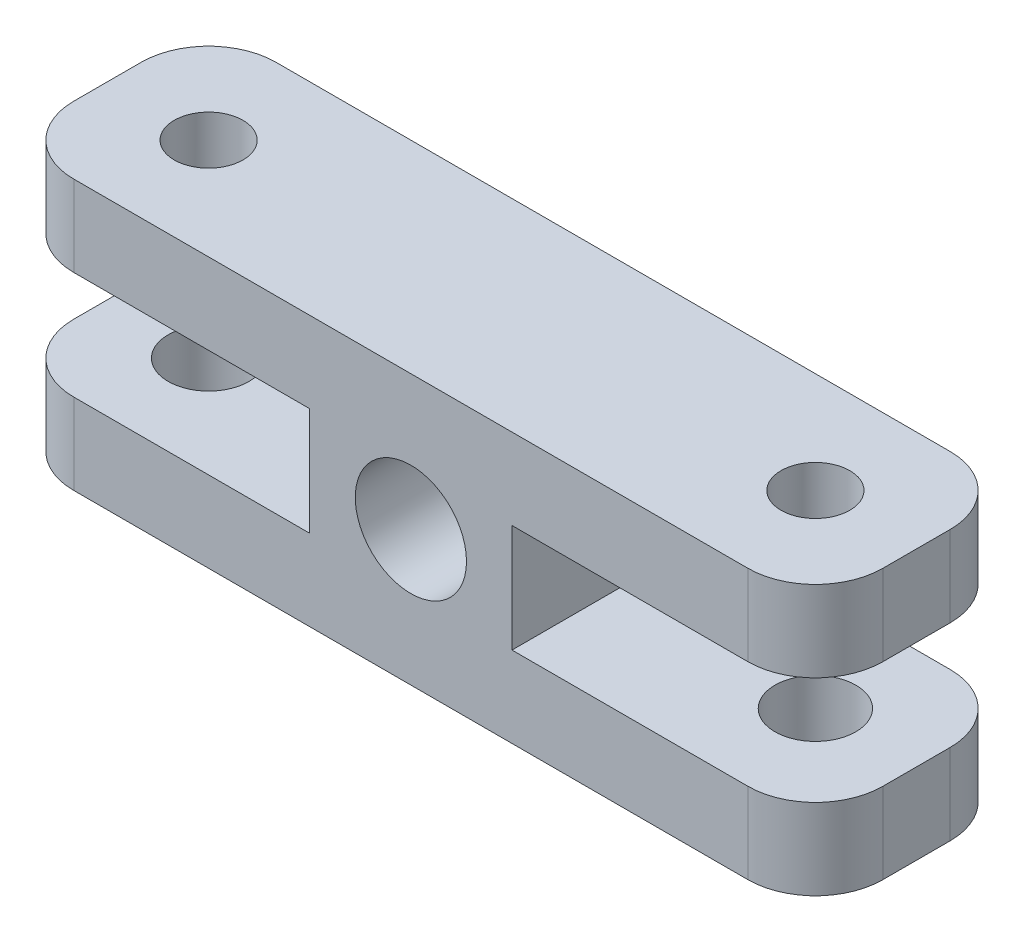
ISO-10303-21;
HEADER;
FILE_DESCRIPTION(('STEP AP214'),'2;1');
FILE_NAME('part.step','',(''),(''),'','','');
FILE_SCHEMA(('AUTOMOTIVE_DESIGN { 1 0 10303 214 1 1 1 1 }'));
ENDSEC;
DATA;
#1=APPLICATION_CONTEXT('core data for automotive mechanical design processes');
#2=APPLICATION_PROTOCOL_DEFINITION('international standard','automotive_design',2000,#1);
#3=PRODUCT_CONTEXT('',#1,'mechanical');
#4=PRODUCT('Part','Part','',(#3));
#5=PRODUCT_RELATED_PRODUCT_CATEGORY('part','',(#4));
#6=PRODUCT_DEFINITION_FORMATION('','',#4);
#7=PRODUCT_DEFINITION_CONTEXT('part definition',#1,'design');
#8=PRODUCT_DEFINITION('design','',#6,#7);
#9=PRODUCT_DEFINITION_SHAPE('','',#8);
#10=(LENGTH_UNIT() NAMED_UNIT(*) SI_UNIT(.MILLI.,.METRE.));
#11=(NAMED_UNIT(*) PLANE_ANGLE_UNIT() SI_UNIT($,.RADIAN.));
#12=(NAMED_UNIT(*) SI_UNIT($,.STERADIAN.) SOLID_ANGLE_UNIT());
#13=UNCERTAINTY_MEASURE_WITH_UNIT(LENGTH_MEASURE(1.E-05),#10,'distance_accuracy_value','');
#14=(GEOMETRIC_REPRESENTATION_CONTEXT(3) GLOBAL_UNCERTAINTY_ASSIGNED_CONTEXT((#13)) GLOBAL_UNIT_ASSIGNED_CONTEXT((#10,
#11,#12)) REPRESENTATION_CONTEXT('',''));
#15=CARTESIAN_POINT('',(0.,0.,0.));
#16=DIRECTION('',(0.,0.,1.));
#17=DIRECTION('',(1.,0.,0.));
#18=AXIS2_PLACEMENT_3D('',#15,#16,#17);
#19=CARTESIAN_POINT('',(60.,-20.,15.));
#20=DIRECTION('',(-1.,0.,0.));
#21=DIRECTION('',(0.,0.,1.));
#22=AXIS2_PLACEMENT_3D('',#19,#20,#21);
#23=PLANE('',#22);
#24=DIRECTION('',(0.,0.,-1.));
#25=VECTOR('',#24,1.);
#26=CARTESIAN_POINT('',(60.,20.,15.));
#27=LINE('',#26,#25);
#28=CARTESIAN_POINT('',(60.,20.,5.));
#29=VERTEX_POINT('',#28);
#30=CARTESIAN_POINT('',(60.,20.,-5.));
#31=VERTEX_POINT('',#30);
#32=EDGE_CURVE('E279',#29,#31,#27,.T.);
#33=ORIENTED_EDGE('',*,*,#32,.F.);
#34=DIRECTION('',(0.,1.,0.));
#35=VECTOR('',#34,1.);
#36=CARTESIAN_POINT('',(60.,-20.,5.));
#37=LINE('',#36,#35);
#38=CARTESIAN_POINT('',(60.,8.,5.));
#39=VERTEX_POINT('',#38);
#40=EDGE_CURVE('E309',#29,#39,#37,.F.);
#41=ORIENTED_EDGE('',*,*,#40,.T.);
#42=DIRECTION('',(0.,0.,1.));
#43=VECTOR('',#42,1.);
#44=CARTESIAN_POINT('',(60.,8.,-15.));
#45=LINE('',#44,#43);
#46=CARTESIAN_POINT('',(60.,8.,-5.));
#47=VERTEX_POINT('',#46);
#48=EDGE_CURVE('E212',#47,#39,#45,.T.);
#49=ORIENTED_EDGE('',*,*,#48,.F.);
#50=DIRECTION('',(0.,1.,0.));
#51=VECTOR('',#50,1.);
#52=CARTESIAN_POINT('',(60.,20.,-5.));
#53=LINE('',#52,#51);
#54=EDGE_CURVE('E306',#47,#31,#53,.T.);
#55=ORIENTED_EDGE('',*,*,#54,.T.);
#56=EDGE_LOOP('',(#33,#41,#49,#55));
#57=FACE_BOUND('',#56,.T.);
#58=ADVANCED_FACE('F37',(#57),#23,.F.);
#59=CARTESIAN_POINT('',(-60.,-20.,15.));
#60=DIRECTION('',(1.,0.,0.));
#61=DIRECTION('',(0.,0.,-1.));
#62=AXIS2_PLACEMENT_3D('',#59,#60,#61);
#63=PLANE('',#62);
#64=DIRECTION('',(0.,0.,1.));
#65=VECTOR('',#64,1.);
#66=CARTESIAN_POINT('',(-60.,7.99999999999999,-15.));
#67=LINE('',#66,#65);
#68=CARTESIAN_POINT('',(-60.,7.99999999999999,-5.));
#69=VERTEX_POINT('',#68);
#70=CARTESIAN_POINT('',(-60.,7.99999999999999,5.));
#71=VERTEX_POINT('',#70);
#72=EDGE_CURVE('E236',#69,#71,#67,.T.);
#73=ORIENTED_EDGE('',*,*,#72,.T.);
#74=DIRECTION('',(0.,-1.,0.));
#75=VECTOR('',#74,1.);
#76=CARTESIAN_POINT('',(-60.,-20.,5.));
#77=LINE('',#76,#75);
#78=CARTESIAN_POINT('',(-60.,20.,5.));
#79=VERTEX_POINT('',#78);
#80=EDGE_CURVE('E346',#71,#79,#77,.F.);
#81=ORIENTED_EDGE('',*,*,#80,.T.);
#82=DIRECTION('',(0.,0.,-1.));
#83=VECTOR('',#82,1.);
#84=CARTESIAN_POINT('',(-60.,20.,15.));
#85=LINE('',#84,#83);
#86=CARTESIAN_POINT('',(-60.,20.,-5.));
#87=VERTEX_POINT('',#86);
#88=EDGE_CURVE('E276',#79,#87,#85,.T.);
#89=ORIENTED_EDGE('',*,*,#88,.T.);
#90=DIRECTION('',(0.,-1.,0.));
#91=VECTOR('',#90,1.);
#92=CARTESIAN_POINT('',(-60.,7.99999999999999,-5.));
#93=LINE('',#92,#91);
#94=EDGE_CURVE('E343',#87,#69,#93,.T.);
#95=ORIENTED_EDGE('',*,*,#94,.T.);
#96=EDGE_LOOP('',(#73,#81,#89,#95));
#97=FACE_BOUND('',#96,.T.);
#98=ADVANCED_FACE('F390',(#97),#63,.F.);
#99=DIRECTION('',(0.,0.,1.));
#100=VECTOR('',#99,1.);
#101=CARTESIAN_POINT('',(60.,-8.,-15.));
#102=LINE('',#101,#100);
#103=CARTESIAN_POINT('',(60.,-8.,-5.));
#104=VERTEX_POINT('',#103);
#105=CARTESIAN_POINT('',(60.,-8.,5.));
#106=VERTEX_POINT('',#105);
#107=EDGE_CURVE('E215',#104,#106,#102,.T.);
#108=ORIENTED_EDGE('',*,*,#107,.T.);
#109=DIRECTION('',(0.,1.,0.));
#110=VECTOR('',#109,1.);
#111=CARTESIAN_POINT('',(60.,-20.,5.));
#112=LINE('',#111,#110);
#113=CARTESIAN_POINT('',(60.,-20.,5.));
#114=VERTEX_POINT('',#113);
#115=EDGE_CURVE('E322',#106,#114,#112,.F.);
#116=ORIENTED_EDGE('',*,*,#115,.T.);
#117=DIRECTION('',(0.,0.,-1.));
#118=VECTOR('',#117,1.);
#119=CARTESIAN_POINT('',(60.,-20.,15.));
#120=LINE('',#119,#118);
#121=CARTESIAN_POINT('',(60.,-20.,-5.));
#122=VERTEX_POINT('',#121);
#123=EDGE_CURVE('E266',#114,#122,#120,.T.);
#124=ORIENTED_EDGE('',*,*,#123,.T.);
#125=DIRECTION('',(0.,1.,0.));
#126=VECTOR('',#125,1.);
#127=CARTESIAN_POINT('',(60.,-8.,-5.));
#128=LINE('',#127,#126);
#129=EDGE_CURVE('E319',#122,#104,#128,.T.);
#130=ORIENTED_EDGE('',*,*,#129,.T.);
#131=EDGE_LOOP('',(#108,#116,#124,#130));
#132=FACE_BOUND('',#131,.T.);
#133=ADVANCED_FACE('F393',(#132),#23,.F.);
#134=CARTESIAN_POINT('',(-60.,20.,15.));
#135=DIRECTION('',(0.,-1.,0.));
#136=DIRECTION('',(0.,0.,-1.));
#137=AXIS2_PLACEMENT_3D('',#134,#135,#136);
#138=PLANE('',#137);
#139=CARTESIAN_POINT('',(-45.,20.,0.));
#140=DIRECTION('',(0.,1.,0.));
#141=DIRECTION('',(0.,0.,1.));
#142=AXIS2_PLACEMENT_3D('',#139,#140,#141);
#143=CIRCLE('',#142,5.09999999999999);
#144=CARTESIAN_POINT('',(-45.,20.,5.1));
#145=VERTEX_POINT('',#144);
#146=EDGE_CURVE('E660',#145,#145,#143,.T.);
#147=ORIENTED_EDGE('',*,*,#146,.F.);
#148=EDGE_LOOP('',(#147));
#149=FACE_BOUND('',#148,.T.);
#150=CARTESIAN_POINT('',(45.,20.,0.));
#151=DIRECTION('',(0.,1.,0.));
#152=DIRECTION('',(0.,0.,1.));
#153=AXIS2_PLACEMENT_3D('',#150,#151,#152);
#154=CIRCLE('',#153,5.09999999999999);
#155=CARTESIAN_POINT('',(45.,20.,5.09999999999999));
#156=VERTEX_POINT('',#155);
#157=EDGE_CURVE('E663',#156,#156,#154,.T.);
#158=ORIENTED_EDGE('',*,*,#157,.F.);
#159=EDGE_LOOP('',(#158));
#160=FACE_BOUND('',#159,.T.);
#161=DIRECTION('',(-1.,0.,0.));
#162=VECTOR('',#161,1.);
#163=CARTESIAN_POINT('',(-60.,20.,15.));
#164=LINE('',#163,#162);
#165=CARTESIAN_POINT('',(50.,20.,15.));
#166=VERTEX_POINT('',#165);
#167=CARTESIAN_POINT('',(-50.,20.,15.));
#168=VERTEX_POINT('',#167);
#169=EDGE_CURVE('E259',#166,#168,#164,.T.);
#170=ORIENTED_EDGE('',*,*,#169,.F.);
#171=CARTESIAN_POINT('',(50.,20.,5.));
#172=DIRECTION('',(0.,-1.,0.));
#173=DIRECTION('',(0.,0.,-1.));
#174=AXIS2_PLACEMENT_3D('',#171,#172,#173);
#175=CIRCLE('',#174,10.);
#176=EDGE_CURVE('E304',#166,#29,#175,.F.);
#177=ORIENTED_EDGE('',*,*,#176,.T.);
#178=ORIENTED_EDGE('',*,*,#32,.T.);
#179=CARTESIAN_POINT('',(50.,20.,-5.));
#180=DIRECTION('',(0.,-1.,0.));
#181=DIRECTION('',(0.,0.,-1.));
#182=AXIS2_PLACEMENT_3D('',#179,#180,#181);
#183=CIRCLE('',#182,10.);
#184=CARTESIAN_POINT('',(50.,20.,-15.));
#185=VERTEX_POINT('',#184);
#186=EDGE_CURVE('E302',#31,#185,#183,.F.);
#187=ORIENTED_EDGE('',*,*,#186,.T.);
#188=DIRECTION('',(-1.,0.,0.));
#189=VECTOR('',#188,1.);
#190=CARTESIAN_POINT('',(-60.,20.,-15.));
#191=LINE('',#190,#189);
#192=CARTESIAN_POINT('',(-50.,20.,-15.));
#193=VERTEX_POINT('',#192);
#194=EDGE_CURVE('E258',#185,#193,#191,.T.);
#195=ORIENTED_EDGE('',*,*,#194,.T.);
#196=CARTESIAN_POINT('',(-50.,20.,-5.));
#197=DIRECTION('',(0.,-1.,0.));
#198=DIRECTION('',(0.,0.,-1.));
#199=AXIS2_PLACEMENT_3D('',#196,#197,#198);
#200=CIRCLE('',#199,10.);
#201=EDGE_CURVE('E298',#193,#87,#200,.F.);
#202=ORIENTED_EDGE('',*,*,#201,.T.);
#203=ORIENTED_EDGE('',*,*,#88,.F.);
#204=CARTESIAN_POINT('',(-50.,20.,5.));
#205=DIRECTION('',(0.,-1.,0.));
#206=DIRECTION('',(0.,0.,-1.));
#207=AXIS2_PLACEMENT_3D('',#204,#205,#206);
#208=CIRCLE('',#207,10.);
#209=EDGE_CURVE('E300',#79,#168,#208,.F.);
#210=ORIENTED_EDGE('',*,*,#209,.T.);
#211=EDGE_LOOP('',(#170,#177,#178,#187,#195,#202,#203,#210));
#212=FACE_BOUND('',#211,.T.);
#213=ADVANCED_FACE('F403',(#149,#160,#212),#138,.F.);
#214=DIRECTION('',(0.,0.,-1.));
#215=VECTOR('',#214,1.);
#216=CARTESIAN_POINT('',(-60.,-20.,15.));
#217=LINE('',#216,#215);
#218=CARTESIAN_POINT('',(-60.,-20.,5.));
#219=VERTEX_POINT('',#218);
#220=CARTESIAN_POINT('',(-60.,-20.,-5.));
#221=VERTEX_POINT('',#220);
#222=EDGE_CURVE('E273',#219,#221,#217,.T.);
#223=ORIENTED_EDGE('',*,*,#222,.F.);
#224=DIRECTION('',(0.,-1.,0.));
#225=VECTOR('',#224,1.);
#226=CARTESIAN_POINT('',(-60.,-20.,5.));
#227=LINE('',#226,#225);
#228=CARTESIAN_POINT('',(-60.,-8.00000000000001,5.));
#229=VERTEX_POINT('',#228);
#230=EDGE_CURVE('E52',#219,#229,#227,.F.);
#231=ORIENTED_EDGE('',*,*,#230,.T.);
#232=DIRECTION('',(0.,0.,1.));
#233=VECTOR('',#232,1.);
#234=CARTESIAN_POINT('',(-60.,-8.00000000000001,-15.));
#235=LINE('',#234,#233);
#236=CARTESIAN_POINT('',(-60.,-8.00000000000001,-5.));
#237=VERTEX_POINT('',#236);
#238=EDGE_CURVE('E228',#237,#229,#235,.T.);
#239=ORIENTED_EDGE('',*,*,#238,.F.);
#240=DIRECTION('',(0.,-1.,0.));
#241=VECTOR('',#240,1.);
#242=CARTESIAN_POINT('',(-60.,-20.,-5.));
#243=LINE('',#242,#241);
#244=EDGE_CURVE('E348',#237,#221,#243,.T.);
#245=ORIENTED_EDGE('',*,*,#244,.T.);
#246=EDGE_LOOP('',(#223,#231,#239,#245));
#247=FACE_BOUND('',#246,.T.);
#248=ADVANCED_FACE('F352',(#247),#63,.F.);
#249=CARTESIAN_POINT('',(-60.,-20.,15.));
#250=DIRECTION('',(0.,1.,0.));
#251=DIRECTION('',(0.,0.,1.));
#252=AXIS2_PLACEMENT_3D('',#249,#250,#251);
#253=PLANE('',#252);
#254=CARTESIAN_POINT('',(45.,-20.,0.));
#255=DIRECTION('',(0.,-1.,0.));
#256=DIRECTION('',(0.,0.,-1.));
#257=AXIS2_PLACEMENT_3D('',#254,#255,#256);
#258=CIRCLE('',#257,6.);
#259=CARTESIAN_POINT('',(45.,-20.,-5.99999999999999));
#260=VERTEX_POINT('',#259);
#261=EDGE_CURVE('E252',#260,#260,#258,.T.);
#262=ORIENTED_EDGE('',*,*,#261,.F.);
#263=EDGE_LOOP('',(#262));
#264=FACE_BOUND('',#263,.T.);
#265=CARTESIAN_POINT('',(-45.,-20.,0.));
#266=DIRECTION('',(0.,-1.,0.));
#267=DIRECTION('',(0.,0.,-1.));
#268=AXIS2_PLACEMENT_3D('',#265,#266,#267);
#269=CIRCLE('',#268,6.);
#270=CARTESIAN_POINT('',(-45.,-20.,-6.));
#271=VERTEX_POINT('',#270);
#272=EDGE_CURVE('E255',#271,#271,#269,.T.);
#273=ORIENTED_EDGE('',*,*,#272,.F.);
#274=EDGE_LOOP('',(#273));
#275=FACE_BOUND('',#274,.T.);
#276=ORIENTED_EDGE('',*,*,#123,.F.);
#277=CARTESIAN_POINT('',(50.,-20.,5.));
#278=DIRECTION('',(0.,1.,0.));
#279=DIRECTION('',(0.,0.,1.));
#280=AXIS2_PLACEMENT_3D('',#277,#278,#279);
#281=CIRCLE('',#280,10.);
#282=CARTESIAN_POINT('',(50.,-20.,15.));
#283=VERTEX_POINT('',#282);
#284=EDGE_CURVE('E330',#114,#283,#281,.F.);
#285=ORIENTED_EDGE('',*,*,#284,.T.);
#286=DIRECTION('',(1.,0.,0.));
#287=VECTOR('',#286,1.);
#288=CARTESIAN_POINT('',(-60.,-20.,15.));
#289=LINE('',#288,#287);
#290=CARTESIAN_POINT('',(-50.,-20.,15.));
#291=VERTEX_POINT('',#290);
#292=EDGE_CURVE('E262',#291,#283,#289,.T.);
#293=ORIENTED_EDGE('',*,*,#292,.F.);
#294=CARTESIAN_POINT('',(-50.,-20.,5.));
#295=DIRECTION('',(0.,1.,0.));
#296=DIRECTION('',(0.,0.,1.));
#297=AXIS2_PLACEMENT_3D('',#294,#295,#296);
#298=CIRCLE('',#297,10.);
#299=EDGE_CURVE('E326',#291,#219,#298,.F.);
#300=ORIENTED_EDGE('',*,*,#299,.T.);
#301=ORIENTED_EDGE('',*,*,#222,.T.);
#302=CARTESIAN_POINT('',(-50.,-20.,-5.));
#303=DIRECTION('',(0.,1.,0.));
#304=DIRECTION('',(0.,0.,1.));
#305=AXIS2_PLACEMENT_3D('',#302,#303,#304);
#306=CIRCLE('',#305,10.);
#307=CARTESIAN_POINT('',(-50.,-20.,-15.));
#308=VERTEX_POINT('',#307);
#309=EDGE_CURVE('E324',#221,#308,#306,.F.);
#310=ORIENTED_EDGE('',*,*,#309,.T.);
#311=DIRECTION('',(1.,0.,0.));
#312=VECTOR('',#311,1.);
#313=CARTESIAN_POINT('',(-60.,-20.,-15.));
#314=LINE('',#313,#312);
#315=CARTESIAN_POINT('',(50.,-20.,-15.));
#316=VERTEX_POINT('',#315);
#317=EDGE_CURVE('E263',#308,#316,#314,.T.);
#318=ORIENTED_EDGE('',*,*,#317,.T.);
#319=CARTESIAN_POINT('',(50.,-20.,-5.));
#320=DIRECTION('',(0.,1.,0.));
#321=DIRECTION('',(0.,0.,1.));
#322=AXIS2_PLACEMENT_3D('',#319,#320,#321);
#323=CIRCLE('',#322,10.);
#324=EDGE_CURVE('E328',#316,#122,#323,.F.);
#325=ORIENTED_EDGE('',*,*,#324,.T.);
#326=EDGE_LOOP('',(#276,#285,#293,#300,#301,#310,#318,#325));
#327=FACE_BOUND('',#326,.T.);
#328=ADVANCED_FACE('F356',(#264,#275,#327),#253,.F.);
#329=CARTESIAN_POINT('',(0.,0.,15.));
#330=DIRECTION('',(0.,0.,-1.));
#331=DIRECTION('',(-1.,0.,0.));
#332=AXIS2_PLACEMENT_3D('',#329,#330,#331);
#333=PLANE('',#332);
#334=CARTESIAN_POINT('',(0.,0.,15.));
#335=DIRECTION('',(0.,0.,1.));
#336=DIRECTION('',(1.,0.,0.));
#337=AXIS2_PLACEMENT_3D('',#334,#335,#336);
#338=CIRCLE('',#337,8.25);
#339=CARTESIAN_POINT('',(8.25,0.,15.));
#340=VERTEX_POINT('',#339);
#341=EDGE_CURVE('E246',#340,#340,#338,.T.);
#342=ORIENTED_EDGE('',*,*,#341,.F.);
#343=EDGE_LOOP('',(#342));
#344=FACE_BOUND('',#343,.T.);
#345=DIRECTION('',(-1.,0.,0.));
#346=VECTOR('',#345,1.);
#347=CARTESIAN_POINT('',(60.,8.,15.));
#348=LINE('',#347,#346);
#349=CARTESIAN_POINT('',(50.,8.,15.));
#350=VERTEX_POINT('',#349);
#351=CARTESIAN_POINT('',(15.,8.,15.));
#352=VERTEX_POINT('',#351);
#353=EDGE_CURVE('E193',#350,#352,#348,.T.);
#354=ORIENTED_EDGE('',*,*,#353,.F.);
#355=DIRECTION('',(0.,1.,0.));
#356=VECTOR('',#355,1.);
#357=CARTESIAN_POINT('',(50.,0.,15.));
#358=LINE('',#357,#356);
#359=EDGE_CURVE('E295',#350,#166,#358,.T.);
#360=ORIENTED_EDGE('',*,*,#359,.T.);
#361=ORIENTED_EDGE('',*,*,#169,.T.);
#362=DIRECTION('',(0.,-1.,0.));
#363=VECTOR('',#362,1.);
#364=CARTESIAN_POINT('',(-50.,0.,15.));
#365=LINE('',#364,#363);
#366=CARTESIAN_POINT('',(-50.,7.99999999999999,15.));
#367=VERTEX_POINT('',#366);
#368=EDGE_CURVE('E289',#168,#367,#365,.T.);
#369=ORIENTED_EDGE('',*,*,#368,.T.);
#370=DIRECTION('',(-1.,0.,0.));
#371=VECTOR('',#370,1.);
#372=CARTESIAN_POINT('',(-60.,7.99999999999999,15.));
#373=LINE('',#372,#371);
#374=CARTESIAN_POINT('',(-15.,8.,15.));
#375=VERTEX_POINT('',#374);
#376=EDGE_CURVE('E222',#375,#367,#373,.T.);
#377=ORIENTED_EDGE('',*,*,#376,.F.);
#378=DIRECTION('',(0.,1.,0.));
#379=VECTOR('',#378,1.);
#380=CARTESIAN_POINT('',(-15.,8.,15.));
#381=LINE('',#380,#379);
#382=CARTESIAN_POINT('',(-15.,-8.00000000000001,15.));
#383=VERTEX_POINT('',#382);
#384=EDGE_CURVE('E231',#383,#375,#381,.T.);
#385=ORIENTED_EDGE('',*,*,#384,.F.);
#386=DIRECTION('',(1.,0.,0.));
#387=VECTOR('',#386,1.);
#388=CARTESIAN_POINT('',(-60.,-8.00000000000001,15.));
#389=LINE('',#388,#387);
#390=CARTESIAN_POINT('',(-50.,-8.00000000000001,15.));
#391=VERTEX_POINT('',#390);
#392=EDGE_CURVE('E229',#391,#383,#389,.T.);
#393=ORIENTED_EDGE('',*,*,#392,.F.);
#394=DIRECTION('',(0.,-1.,0.));
#395=VECTOR('',#394,1.);
#396=CARTESIAN_POINT('',(-50.,0.,15.));
#397=LINE('',#396,#395);
#398=EDGE_CURVE('E282',#391,#291,#397,.T.);
#399=ORIENTED_EDGE('',*,*,#398,.T.);
#400=ORIENTED_EDGE('',*,*,#292,.T.);
#401=DIRECTION('',(0.,1.,0.));
#402=VECTOR('',#401,1.);
#403=CARTESIAN_POINT('',(50.,0.,15.));
#404=LINE('',#403,#402);
#405=CARTESIAN_POINT('',(50.,-8.,15.));
#406=VERTEX_POINT('',#405);
#407=EDGE_CURVE('E292',#283,#406,#404,.T.);
#408=ORIENTED_EDGE('',*,*,#407,.T.);
#409=DIRECTION('',(1.,0.,0.));
#410=VECTOR('',#409,1.);
#411=CARTESIAN_POINT('',(60.,-8.,15.));
#412=LINE('',#411,#410);
#413=CARTESIAN_POINT('',(15.,-8.00000000000001,15.));
#414=VERTEX_POINT('',#413);
#415=EDGE_CURVE('E186',#414,#406,#412,.T.);
#416=ORIENTED_EDGE('',*,*,#415,.F.);
#417=DIRECTION('',(0.,-1.,0.));
#418=VECTOR('',#417,1.);
#419=CARTESIAN_POINT('',(15.,8.,15.));
#420=LINE('',#419,#418);
#421=EDGE_CURVE('E207',#352,#414,#420,.T.);
#422=ORIENTED_EDGE('',*,*,#421,.F.);
#423=EDGE_LOOP('',(#354,#360,#361,#369,#377,#385,#393,#399,#400,#408,#416,#422));
#424=FACE_BOUND('',#423,.T.);
#425=ADVANCED_FACE('F365',(#344,#424),#333,.F.);
#426=CARTESIAN_POINT('',(0.,0.,-15.));
#427=DIRECTION('',(0.,0.,-1.));
#428=DIRECTION('',(-1.,0.,0.));
#429=AXIS2_PLACEMENT_3D('',#426,#427,#428);
#430=PLANE('',#429);
#431=DIRECTION('',(1.,0.,0.));
#432=VECTOR('',#431,1.);
#433=CARTESIAN_POINT('',(60.,-8.,-15.));
#434=LINE('',#433,#432);
#435=CARTESIAN_POINT('',(15.,-8.00000000000001,-15.));
#436=VERTEX_POINT('',#435);
#437=CARTESIAN_POINT('',(50.,-8.,-15.));
#438=VERTEX_POINT('',#437);
#439=EDGE_CURVE('E198',#436,#438,#434,.T.);
#440=ORIENTED_EDGE('',*,*,#439,.T.);
#441=DIRECTION('',(0.,1.,0.));
#442=VECTOR('',#441,1.);
#443=CARTESIAN_POINT('',(50.,-20.,-15.));
#444=LINE('',#443,#442);
#445=EDGE_CURVE('E337',#438,#316,#444,.F.);
#446=ORIENTED_EDGE('',*,*,#445,.T.);
#447=ORIENTED_EDGE('',*,*,#317,.F.);
#448=DIRECTION('',(0.,-1.,0.));
#449=VECTOR('',#448,1.);
#450=CARTESIAN_POINT('',(-50.,-8.00000000000001,-15.));
#451=LINE('',#450,#449);
#452=CARTESIAN_POINT('',(-50.,-8.00000000000001,-15.));
#453=VERTEX_POINT('',#452);
#454=EDGE_CURVE('E332',#308,#453,#451,.F.);
#455=ORIENTED_EDGE('',*,*,#454,.T.);
#456=DIRECTION('',(1.,0.,0.));
#457=VECTOR('',#456,1.);
#458=CARTESIAN_POINT('',(-60.,-8.00000000000001,-15.));
#459=LINE('',#458,#457);
#460=CARTESIAN_POINT('',(-15.,-8.00000000000001,-15.));
#461=VERTEX_POINT('',#460);
#462=EDGE_CURVE('E219',#453,#461,#459,.T.);
#463=ORIENTED_EDGE('',*,*,#462,.T.);
#464=DIRECTION('',(0.,1.,0.));
#465=VECTOR('',#464,1.);
#466=CARTESIAN_POINT('',(-15.,8.,-15.));
#467=LINE('',#466,#465);
#468=CARTESIAN_POINT('',(-15.,8.,-15.));
#469=VERTEX_POINT('',#468);
#470=EDGE_CURVE('E221',#461,#469,#467,.T.);
#471=ORIENTED_EDGE('',*,*,#470,.T.);
#472=DIRECTION('',(-1.,0.,0.));
#473=VECTOR('',#472,1.);
#474=CARTESIAN_POINT('',(-60.,7.99999999999999,-15.));
#475=LINE('',#474,#473);
#476=CARTESIAN_POINT('',(-50.,7.99999999999999,-15.));
#477=VERTEX_POINT('',#476);
#478=EDGE_CURVE('E225',#469,#477,#475,.T.);
#479=ORIENTED_EDGE('',*,*,#478,.T.);
#480=DIRECTION('',(0.,-1.,0.));
#481=VECTOR('',#480,1.);
#482=CARTESIAN_POINT('',(-50.,20.,-15.));
#483=LINE('',#482,#481);
#484=EDGE_CURVE('E334',#477,#193,#483,.F.);
#485=ORIENTED_EDGE('',*,*,#484,.T.);
#486=ORIENTED_EDGE('',*,*,#194,.F.);
#487=DIRECTION('',(0.,1.,0.));
#488=VECTOR('',#487,1.);
#489=CARTESIAN_POINT('',(50.,8.,-15.));
#490=LINE('',#489,#488);
#491=CARTESIAN_POINT('',(50.,8.,-15.));
#492=VERTEX_POINT('',#491);
#493=EDGE_CURVE('E183',#185,#492,#490,.F.);
#494=ORIENTED_EDGE('',*,*,#493,.T.);
#495=DIRECTION('',(-1.,0.,0.));
#496=VECTOR('',#495,1.);
#497=CARTESIAN_POINT('',(60.,8.,-15.));
#498=LINE('',#497,#496);
#499=CARTESIAN_POINT('',(15.,8.,-15.));
#500=VERTEX_POINT('',#499);
#501=EDGE_CURVE('E174',#492,#500,#498,.T.);
#502=ORIENTED_EDGE('',*,*,#501,.T.);
#503=DIRECTION('',(0.,-1.,0.));
#504=VECTOR('',#503,1.);
#505=CARTESIAN_POINT('',(15.,8.,-15.));
#506=LINE('',#505,#504);
#507=EDGE_CURVE('E180',#500,#436,#506,.T.);
#508=ORIENTED_EDGE('',*,*,#507,.T.);
#509=EDGE_LOOP('',(#440,#446,#447,#455,#463,#471,#479,#485,#486,#494,#502,#508));
#510=FACE_BOUND('',#509,.T.);
#511=CARTESIAN_POINT('',(0.,0.,-15.));
#512=DIRECTION('',(0.,0.,1.));
#513=DIRECTION('',(1.,0.,0.));
#514=AXIS2_PLACEMENT_3D('',#511,#512,#513);
#515=CIRCLE('',#514,8.24999999999999);
#516=CARTESIAN_POINT('',(8.24999999999999,0.,-15.));
#517=VERTEX_POINT('',#516);
#518=EDGE_CURVE('E249',#517,#517,#515,.T.);
#519=ORIENTED_EDGE('',*,*,#518,.T.);
#520=EDGE_LOOP('',(#519));
#521=FACE_BOUND('',#520,.T.);
#522=ADVANCED_FACE('F177',(#510,#521),#430,.T.);
#523=CARTESIAN_POINT('',(-45.,0.,0.));
#524=DIRECTION('',(0.,-1.,0.));
#525=DIRECTION('',(0.,0.,-1.));
#526=AXIS2_PLACEMENT_3D('',#523,#524,#525);
#527=CYLINDRICAL_SURFACE('',#526,6.);
#528=CARTESIAN_POINT('',(-45.,-8.00000000000001,0.));
#529=DIRECTION('',(0.,-1.,0.));
#530=DIRECTION('',(1.,0.,0.));
#531=AXIS2_PLACEMENT_3D('',#528,#529,#530);
#532=CIRCLE('',#531,6.);
#533=CARTESIAN_POINT('',(-39.,-8.00000000000001,0.));
#534=VERTEX_POINT('',#533);
#535=EDGE_CURVE('E239',#534,#534,#532,.F.);
#536=ORIENTED_EDGE('',*,*,#535,.T.);
#537=EDGE_LOOP('',(#536));
#538=FACE_BOUND('',#537,.T.);
#539=ORIENTED_EDGE('',*,*,#272,.T.);
#540=EDGE_LOOP('',(#539));
#541=FACE_BOUND('',#540,.T.);
#542=ADVANCED_FACE('F465',(#538,#541),#527,.F.);
#543=CARTESIAN_POINT('',(45.,0.,0.));
#544=DIRECTION('',(0.,-1.,0.));
#545=DIRECTION('',(0.,0.,-1.));
#546=AXIS2_PLACEMENT_3D('',#543,#544,#545);
#547=CYLINDRICAL_SURFACE('',#546,6.);
#548=CARTESIAN_POINT('',(45.,-8.,0.));
#549=DIRECTION('',(0.,-1.,0.));
#550=DIRECTION('',(1.,0.,0.));
#551=AXIS2_PLACEMENT_3D('',#548,#549,#550);
#552=CIRCLE('',#551,6.);
#553=CARTESIAN_POINT('',(51.,-8.,0.));
#554=VERTEX_POINT('',#553);
#555=EDGE_CURVE('E214',#554,#554,#552,.F.);
#556=ORIENTED_EDGE('',*,*,#555,.T.);
#557=EDGE_LOOP('',(#556));
#558=FACE_BOUND('',#557,.T.);
#559=ORIENTED_EDGE('',*,*,#261,.T.);
#560=EDGE_LOOP('',(#559));
#561=FACE_BOUND('',#560,.T.);
#562=ADVANCED_FACE('F461',(#558,#561),#547,.F.);
#563=CARTESIAN_POINT('',(0.,0.,15.));
#564=DIRECTION('',(0.,0.,1.));
#565=DIRECTION('',(1.,0.,0.));
#566=AXIS2_PLACEMENT_3D('',#563,#564,#565);
#567=CYLINDRICAL_SURFACE('',#566,8.25);
#568=ORIENTED_EDGE('',*,*,#518,.F.);
#569=EDGE_LOOP('',(#568));
#570=FACE_BOUND('',#569,.T.);
#571=ORIENTED_EDGE('',*,*,#341,.T.);
#572=EDGE_LOOP('',(#571));
#573=FACE_BOUND('',#572,.T.);
#574=ADVANCED_FACE('F453',(#570,#573),#567,.F.);
#575=CARTESIAN_POINT('',(-60.,-8.00000000000001,-15.));
#576=DIRECTION('',(0.,-1.,0.));
#577=DIRECTION('',(1.,0.,0.));
#578=AXIS2_PLACEMENT_3D('',#575,#576,#577);
#579=PLANE('',#578);
#580=ORIENTED_EDGE('',*,*,#238,.T.);
#581=CARTESIAN_POINT('',(-50.,-8.00000000000001,5.));
#582=DIRECTION('',(0.,-1.,0.));
#583=DIRECTION('',(1.,0.,0.));
#584=AXIS2_PLACEMENT_3D('',#581,#582,#583);
#585=CIRCLE('',#584,10.);
#586=EDGE_CURVE('E11',#229,#391,#585,.F.);
#587=ORIENTED_EDGE('',*,*,#586,.T.);
#588=ORIENTED_EDGE('',*,*,#392,.T.);
#589=DIRECTION('',(0.,0.,1.));
#590=VECTOR('',#589,1.);
#591=CARTESIAN_POINT('',(-15.,-8.00000000000001,-15.));
#592=LINE('',#591,#590);
#593=EDGE_CURVE('E242',#461,#383,#592,.T.);
#594=ORIENTED_EDGE('',*,*,#593,.F.);
#595=ORIENTED_EDGE('',*,*,#462,.F.);
#596=CARTESIAN_POINT('',(-50.,-8.00000000000001,-5.));
#597=DIRECTION('',(0.,-1.,0.));
#598=DIRECTION('',(1.,0.,0.));
#599=AXIS2_PLACEMENT_3D('',#596,#597,#598);
#600=CIRCLE('',#599,10.);
#601=EDGE_CURVE('E45',#453,#237,#600,.F.);
#602=ORIENTED_EDGE('',*,*,#601,.T.);
#603=EDGE_LOOP('',(#580,#587,#588,#594,#595,#602));
#604=FACE_BOUND('',#603,.T.);
#605=ORIENTED_EDGE('',*,*,#535,.F.);
#606=EDGE_LOOP('',(#605));
#607=FACE_BOUND('',#606,.T.);
#608=ADVANCED_FACE('F370',(#604,#607),#579,.F.);
#609=CARTESIAN_POINT('',(-60.,7.99999999999999,-15.));
#610=DIRECTION('',(0.,1.,0.));
#611=DIRECTION('',(-1.,0.,0.));
#612=AXIS2_PLACEMENT_3D('',#609,#610,#611);
#613=PLANE('',#612);
#614=CARTESIAN_POINT('',(-45.,7.99999999999999,0.));
#615=DIRECTION('',(0.,1.,0.));
#616=DIRECTION('',(-1.,0.,0.));
#617=AXIS2_PLACEMENT_3D('',#614,#615,#616);
#618=CIRCLE('',#617,5.09999999999999);
#619=CARTESIAN_POINT('',(-50.1,7.99999999999999,0.));
#620=VERTEX_POINT('',#619);
#621=EDGE_CURVE('E662',#620,#620,#618,.T.);
#622=ORIENTED_EDGE('',*,*,#621,.T.);
#623=EDGE_LOOP('',(#622));
#624=FACE_BOUND('',#623,.T.);
#625=ORIENTED_EDGE('',*,*,#376,.T.);
#626=CARTESIAN_POINT('',(-50.,7.99999999999999,5.));
#627=DIRECTION('',(0.,1.,0.));
#628=DIRECTION('',(-1.,0.,0.));
#629=AXIS2_PLACEMENT_3D('',#626,#627,#628);
#630=CIRCLE('',#629,10.);
#631=EDGE_CURVE('E341',#367,#71,#630,.F.);
#632=ORIENTED_EDGE('',*,*,#631,.T.);
#633=ORIENTED_EDGE('',*,*,#72,.F.);
#634=CARTESIAN_POINT('',(-50.,7.99999999999999,-5.));
#635=DIRECTION('',(0.,1.,0.));
#636=DIRECTION('',(-1.,0.,0.));
#637=AXIS2_PLACEMENT_3D('',#634,#635,#636);
#638=CIRCLE('',#637,10.);
#639=EDGE_CURVE('E339',#69,#477,#638,.F.);
#640=ORIENTED_EDGE('',*,*,#639,.T.);
#641=ORIENTED_EDGE('',*,*,#478,.F.);
#642=DIRECTION('',(0.,0.,1.));
#643=VECTOR('',#642,1.);
#644=CARTESIAN_POINT('',(-15.,8.,-15.));
#645=LINE('',#644,#643);
#646=EDGE_CURVE('E240',#469,#375,#645,.T.);
#647=ORIENTED_EDGE('',*,*,#646,.T.);
#648=EDGE_LOOP('',(#625,#632,#633,#640,#641,#647));
#649=FACE_BOUND('',#648,.T.);
#650=ADVANCED_FACE('F444',(#624,#649),#613,.F.);
#651=CARTESIAN_POINT('',(-15.,8.,-15.));
#652=DIRECTION('',(1.,0.,0.));
#653=DIRECTION('',(0.,1.,0.));
#654=AXIS2_PLACEMENT_3D('',#651,#652,#653);
#655=PLANE('',#654);
#656=ORIENTED_EDGE('',*,*,#384,.T.);
#657=ORIENTED_EDGE('',*,*,#646,.F.);
#658=ORIENTED_EDGE('',*,*,#470,.F.);
#659=ORIENTED_EDGE('',*,*,#593,.T.);
#660=EDGE_LOOP('',(#656,#657,#658,#659));
#661=FACE_BOUND('',#660,.T.);
#662=ADVANCED_FACE('F374',(#661),#655,.F.);
#663=CARTESIAN_POINT('',(60.,-8.,-15.));
#664=DIRECTION('',(0.,-1.,0.));
#665=DIRECTION('',(1.,0.,0.));
#666=AXIS2_PLACEMENT_3D('',#663,#664,#665);
#667=PLANE('',#666);
#668=ORIENTED_EDGE('',*,*,#415,.T.);
#669=CARTESIAN_POINT('',(50.,-8.,5.));
#670=DIRECTION('',(0.,-1.,0.));
#671=DIRECTION('',(1.,0.,0.));
#672=AXIS2_PLACEMENT_3D('',#669,#670,#671);
#673=CIRCLE('',#672,10.);
#674=EDGE_CURVE('E317',#406,#106,#673,.F.);
#675=ORIENTED_EDGE('',*,*,#674,.T.);
#676=ORIENTED_EDGE('',*,*,#107,.F.);
#677=CARTESIAN_POINT('',(50.,-8.,-5.));
#678=DIRECTION('',(0.,-1.,0.));
#679=DIRECTION('',(1.,0.,0.));
#680=AXIS2_PLACEMENT_3D('',#677,#678,#679);
#681=CIRCLE('',#680,10.);
#682=EDGE_CURVE('E315',#104,#438,#681,.F.);
#683=ORIENTED_EDGE('',*,*,#682,.T.);
#684=ORIENTED_EDGE('',*,*,#439,.F.);
#685=DIRECTION('',(0.,0.,1.));
#686=VECTOR('',#685,1.);
#687=CARTESIAN_POINT('',(15.,-8.00000000000001,-15.));
#688=LINE('',#687,#686);
#689=EDGE_CURVE('E197',#436,#414,#688,.T.);
#690=ORIENTED_EDGE('',*,*,#689,.T.);
#691=EDGE_LOOP('',(#668,#675,#676,#683,#684,#690));
#692=FACE_BOUND('',#691,.T.);
#693=ORIENTED_EDGE('',*,*,#555,.F.);
#694=EDGE_LOOP('',(#693));
#695=FACE_BOUND('',#694,.T.);
#696=ADVANCED_FACE('F420',(#692,#695),#667,.F.);
#697=CARTESIAN_POINT('',(60.,8.,-15.));
#698=DIRECTION('',(0.,1.,0.));
#699=DIRECTION('',(-1.,0.,0.));
#700=AXIS2_PLACEMENT_3D('',#697,#698,#699);
#701=PLANE('',#700);
#702=CARTESIAN_POINT('',(45.,8.,0.));
#703=DIRECTION('',(0.,1.,0.));
#704=DIRECTION('',(-1.,0.,0.));
#705=AXIS2_PLACEMENT_3D('',#702,#703,#704);
#706=CIRCLE('',#705,5.09999999999999);
#707=CARTESIAN_POINT('',(39.9,8.,0.));
#708=VERTEX_POINT('',#707);
#709=EDGE_CURVE('E208',#708,#708,#706,.T.);
#710=ORIENTED_EDGE('',*,*,#709,.T.);
#711=EDGE_LOOP('',(#710));
#712=FACE_BOUND('',#711,.T.);
#713=ORIENTED_EDGE('',*,*,#48,.T.);
#714=CARTESIAN_POINT('',(50.,8.,5.));
#715=DIRECTION('',(0.,1.,0.));
#716=DIRECTION('',(-1.,0.,0.));
#717=AXIS2_PLACEMENT_3D('',#714,#715,#716);
#718=CIRCLE('',#717,10.);
#719=EDGE_CURVE('E313',#39,#350,#718,.F.);
#720=ORIENTED_EDGE('',*,*,#719,.T.);
#721=ORIENTED_EDGE('',*,*,#353,.T.);
#722=DIRECTION('',(0.,0.,1.));
#723=VECTOR('',#722,1.);
#724=CARTESIAN_POINT('',(15.,8.,-15.));
#725=LINE('',#724,#723);
#726=EDGE_CURVE('E189',#500,#352,#725,.T.);
#727=ORIENTED_EDGE('',*,*,#726,.F.);
#728=ORIENTED_EDGE('',*,*,#501,.F.);
#729=CARTESIAN_POINT('',(50.,8.,-5.));
#730=DIRECTION('',(0.,1.,0.));
#731=DIRECTION('',(-1.,0.,0.));
#732=AXIS2_PLACEMENT_3D('',#729,#730,#731);
#733=CIRCLE('',#732,10.);
#734=EDGE_CURVE('E311',#492,#47,#733,.F.);
#735=ORIENTED_EDGE('',*,*,#734,.T.);
#736=EDGE_LOOP('',(#713,#720,#721,#727,#728,#735));
#737=FACE_BOUND('',#736,.T.);
#738=ADVANCED_FACE('F191',(#712,#737),#701,.F.);
#739=CARTESIAN_POINT('',(15.,8.,-15.));
#740=DIRECTION('',(-1.,0.,0.));
#741=DIRECTION('',(0.,-1.,0.));
#742=AXIS2_PLACEMENT_3D('',#739,#740,#741);
#743=PLANE('',#742);
#744=ORIENTED_EDGE('',*,*,#421,.T.);
#745=ORIENTED_EDGE('',*,*,#689,.F.);
#746=ORIENTED_EDGE('',*,*,#507,.F.);
#747=ORIENTED_EDGE('',*,*,#726,.T.);
#748=EDGE_LOOP('',(#744,#745,#746,#747));
#749=FACE_BOUND('',#748,.T.);
#750=ADVANCED_FACE('F201',(#749),#743,.F.);
#751=CARTESIAN_POINT('',(50.,0.,5.));
#752=DIRECTION('',(0.,1.,0.));
#753=DIRECTION('',(0.,0.,1.));
#754=AXIS2_PLACEMENT_3D('',#751,#752,#753);
#755=CYLINDRICAL_SURFACE('',#754,10.);
#756=ORIENTED_EDGE('',*,*,#719,.F.);
#757=ORIENTED_EDGE('',*,*,#40,.F.);
#758=ORIENTED_EDGE('',*,*,#176,.F.);
#759=ORIENTED_EDGE('',*,*,#359,.F.);
#760=EDGE_LOOP('',(#756,#757,#758,#759));
#761=FACE_BOUND('',#760,.T.);
#762=ADVANCED_FACE('F427',(#761),#755,.T.);
#763=CARTESIAN_POINT('',(50.,0.,5.));
#764=DIRECTION('',(0.,1.,0.));
#765=DIRECTION('',(0.,0.,1.));
#766=AXIS2_PLACEMENT_3D('',#763,#764,#765);
#767=CYLINDRICAL_SURFACE('',#766,10.);
#768=ORIENTED_EDGE('',*,*,#284,.F.);
#769=ORIENTED_EDGE('',*,*,#115,.F.);
#770=ORIENTED_EDGE('',*,*,#674,.F.);
#771=ORIENTED_EDGE('',*,*,#407,.F.);
#772=EDGE_LOOP('',(#768,#769,#770,#771));
#773=FACE_BOUND('',#772,.T.);
#774=ADVANCED_FACE('F415',(#773),#767,.T.);
#775=CARTESIAN_POINT('',(50.,-20.,-5.));
#776=DIRECTION('',(0.,-1.,0.));
#777=DIRECTION('',(0.,0.,-1.));
#778=AXIS2_PLACEMENT_3D('',#775,#776,#777);
#779=CYLINDRICAL_SURFACE('',#778,10.);
#780=ORIENTED_EDGE('',*,*,#324,.F.);
#781=ORIENTED_EDGE('',*,*,#445,.F.);
#782=ORIENTED_EDGE('',*,*,#682,.F.);
#783=ORIENTED_EDGE('',*,*,#129,.F.);
#784=EDGE_LOOP('',(#780,#781,#782,#783));
#785=FACE_BOUND('',#784,.T.);
#786=ADVANCED_FACE('F418',(#785),#779,.T.);
#787=CARTESIAN_POINT('',(50.,-20.,-5.));
#788=DIRECTION('',(0.,-1.,0.));
#789=DIRECTION('',(0.,0.,-1.));
#790=AXIS2_PLACEMENT_3D('',#787,#788,#789);
#791=CYLINDRICAL_SURFACE('',#790,10.);
#792=ORIENTED_EDGE('',*,*,#734,.F.);
#793=ORIENTED_EDGE('',*,*,#493,.F.);
#794=ORIENTED_EDGE('',*,*,#186,.F.);
#795=ORIENTED_EDGE('',*,*,#54,.F.);
#796=EDGE_LOOP('',(#792,#793,#794,#795));
#797=FACE_BOUND('',#796,.T.);
#798=ADVANCED_FACE('F433',(#797),#791,.T.);
#799=CARTESIAN_POINT('',(-50.,0.,5.));
#800=DIRECTION('',(0.,-1.,0.));
#801=DIRECTION('',(0.,0.,-1.));
#802=AXIS2_PLACEMENT_3D('',#799,#800,#801);
#803=CYLINDRICAL_SURFACE('',#802,10.);
#804=ORIENTED_EDGE('',*,*,#209,.F.);
#805=ORIENTED_EDGE('',*,*,#80,.F.);
#806=ORIENTED_EDGE('',*,*,#631,.F.);
#807=ORIENTED_EDGE('',*,*,#368,.F.);
#808=EDGE_LOOP('',(#804,#805,#806,#807));
#809=FACE_BOUND('',#808,.T.);
#810=ADVANCED_FACE('F441',(#809),#803,.T.);
#811=CARTESIAN_POINT('',(-50.,0.,5.));
#812=DIRECTION('',(0.,-1.,0.));
#813=DIRECTION('',(0.,0.,-1.));
#814=AXIS2_PLACEMENT_3D('',#811,#812,#813);
#815=CYLINDRICAL_SURFACE('',#814,10.);
#816=ORIENTED_EDGE('',*,*,#586,.F.);
#817=ORIENTED_EDGE('',*,*,#230,.F.);
#818=ORIENTED_EDGE('',*,*,#299,.F.);
#819=ORIENTED_EDGE('',*,*,#398,.F.);
#820=EDGE_LOOP('',(#816,#817,#818,#819));
#821=FACE_BOUND('',#820,.T.);
#822=ADVANCED_FACE('F362',(#821),#815,.T.);
#823=CARTESIAN_POINT('',(-50.,-20.,-5.));
#824=DIRECTION('',(0.,1.,0.));
#825=DIRECTION('',(0.,0.,1.));
#826=AXIS2_PLACEMENT_3D('',#823,#824,#825);
#827=CYLINDRICAL_SURFACE('',#826,10.);
#828=ORIENTED_EDGE('',*,*,#201,.F.);
#829=ORIENTED_EDGE('',*,*,#484,.F.);
#830=ORIENTED_EDGE('',*,*,#639,.F.);
#831=ORIENTED_EDGE('',*,*,#94,.F.);
#832=EDGE_LOOP('',(#828,#829,#830,#831));
#833=FACE_BOUND('',#832,.T.);
#834=ADVANCED_FACE('F380',(#833),#827,.T.);
#835=CARTESIAN_POINT('',(-50.,-20.,-5.));
#836=DIRECTION('',(0.,1.,0.));
#837=DIRECTION('',(0.,0.,1.));
#838=AXIS2_PLACEMENT_3D('',#835,#836,#837);
#839=CYLINDRICAL_SURFACE('',#838,10.);
#840=ORIENTED_EDGE('',*,*,#601,.F.);
#841=ORIENTED_EDGE('',*,*,#454,.F.);
#842=ORIENTED_EDGE('',*,*,#309,.F.);
#843=ORIENTED_EDGE('',*,*,#244,.F.);
#844=EDGE_LOOP('',(#840,#841,#842,#843));
#845=FACE_BOUND('',#844,.T.);
#846=ADVANCED_FACE('F39',(#845),#839,.T.);
#847=CARTESIAN_POINT('',(45.,20.,0.));
#848=DIRECTION('',(0.,1.,0.));
#849=DIRECTION('',(0.,0.,1.));
#850=AXIS2_PLACEMENT_3D('',#847,#848,#849);
#851=CYLINDRICAL_SURFACE('',#850,5.09999999999999);
#852=ORIENTED_EDGE('',*,*,#157,.T.);
#853=EDGE_LOOP('',(#852));
#854=FACE_BOUND('',#853,.T.);
#855=ORIENTED_EDGE('',*,*,#709,.F.);
#856=EDGE_LOOP('',(#855));
#857=FACE_BOUND('',#856,.T.);
#858=ADVANCED_FACE('F379',(#854,#857),#851,.F.);
#859=CARTESIAN_POINT('',(-45.,20.,0.));
#860=DIRECTION('',(0.,1.,0.));
#861=DIRECTION('',(0.,0.,1.));
#862=AXIS2_PLACEMENT_3D('',#859,#860,#861);
#863=CYLINDRICAL_SURFACE('',#862,5.09999999999999);
#864=ORIENTED_EDGE('',*,*,#146,.T.);
#865=EDGE_LOOP('',(#864));
#866=FACE_BOUND('',#865,.T.);
#867=ORIENTED_EDGE('',*,*,#621,.F.);
#868=EDGE_LOOP('',(#867));
#869=FACE_BOUND('',#868,.T.);
#870=ADVANCED_FACE('F385',(#866,#869),#863,.F.);
#871=CLOSED_SHELL('',(#58,#98,#133,#213,#248,#328,#425,#522,#542,#562,#574,#608,#650,#662,#696,
#738,#750,#762,#774,#786,#798,#810,#822,#834,#846,#858,#870));
#872=MANIFOLD_SOLID_BREP('B2',#871);
#873=ADVANCED_BREP_SHAPE_REPRESENTATION('',(#18,#872),#14);
#874=SHAPE_DEFINITION_REPRESENTATION(#9,#873);
ENDSEC;
END-ISO-10303-21;
